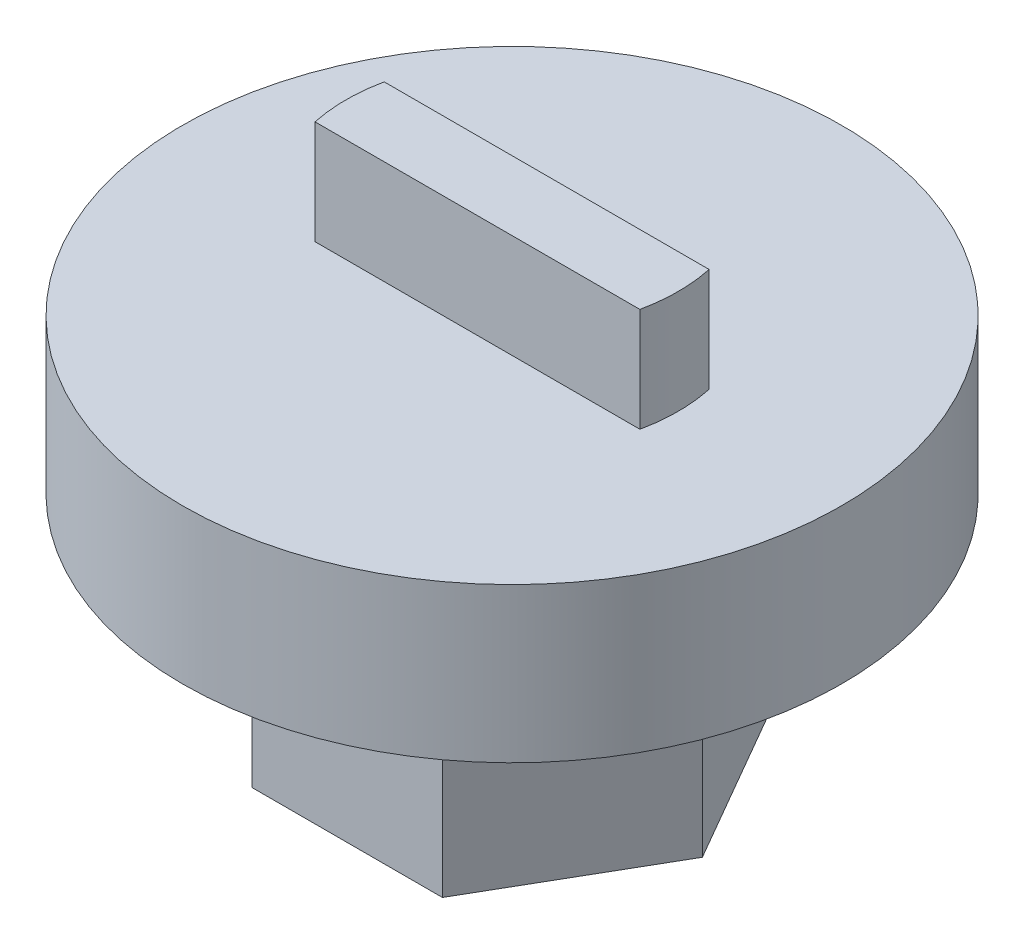
ISO-10303-21;
HEADER;
FILE_DESCRIPTION(('STEP AP214'),'2;1');
FILE_NAME('part.step','',(''),(''),'','','');
FILE_SCHEMA(('AUTOMOTIVE_DESIGN { 1 0 10303 214 1 1 1 1 }'));
ENDSEC;
DATA;
#1=APPLICATION_CONTEXT('core data for automotive mechanical design processes');
#2=APPLICATION_PROTOCOL_DEFINITION('international standard','automotive_design',2000,#1);
#3=PRODUCT_CONTEXT('',#1,'mechanical');
#4=PRODUCT('Part','Part','',(#3));
#5=PRODUCT_RELATED_PRODUCT_CATEGORY('part','',(#4));
#6=PRODUCT_DEFINITION_FORMATION('','',#4);
#7=PRODUCT_DEFINITION_CONTEXT('part definition',#1,'design');
#8=PRODUCT_DEFINITION('design','',#6,#7);
#9=PRODUCT_DEFINITION_SHAPE('','',#8);
#10=(LENGTH_UNIT() NAMED_UNIT(*) SI_UNIT(.MILLI.,.METRE.));
#11=(NAMED_UNIT(*) PLANE_ANGLE_UNIT() SI_UNIT($,.RADIAN.));
#12=(NAMED_UNIT(*) SI_UNIT($,.STERADIAN.) SOLID_ANGLE_UNIT());
#13=UNCERTAINTY_MEASURE_WITH_UNIT(LENGTH_MEASURE(1.E-05),#10,'distance_accuracy_value','');
#14=(GEOMETRIC_REPRESENTATION_CONTEXT(3) GLOBAL_UNCERTAINTY_ASSIGNED_CONTEXT((#13)) GLOBAL_UNIT_ASSIGNED_CONTEXT((#10,
#11,#12)) REPRESENTATION_CONTEXT('',''));
#15=CARTESIAN_POINT('',(0.,0.,0.));
#16=DIRECTION('',(0.,0.,1.));
#17=DIRECTION('',(1.,0.,0.));
#18=AXIS2_PLACEMENT_3D('',#15,#16,#17);
#19=CARTESIAN_POINT('',(0.,5.40512,0.));
#20=DIRECTION('',(0.,1.,0.));
#21=DIRECTION('',(0.,0.,1.));
#22=AXIS2_PLACEMENT_3D('',#19,#20,#21);
#23=PLANE('',#22);
#24=CARTESIAN_POINT('',(0.,5.40512,0.));
#25=DIRECTION('',(0.,1.,0.));
#26=DIRECTION('',(0.,0.,1.));
#27=AXIS2_PLACEMENT_3D('',#24,#25,#26);
#28=CIRCLE('',#27,4.7625);
#29=CARTESIAN_POINT('',(0.,5.40512,4.7625));
#30=VERTEX_POINT('',#29);
#31=EDGE_CURVE('E136',#30,#30,#28,.T.);
#32=ORIENTED_EDGE('',*,*,#31,.T.);
#33=EDGE_LOOP('',(#32));
#34=FACE_BOUND('',#33,.T.);
#35=DIRECTION('',(1.,0.,0.));
#36=VECTOR('',#35,1.);
#37=CARTESIAN_POINT('',(2.3473389188611,5.40512,0.5));
#38=LINE('',#37,#36);
#39=CARTESIAN_POINT('',(-2.3473389188611,5.40512,0.5));
#40=VERTEX_POINT('',#39);
#41=CARTESIAN_POINT('',(2.3473389188611,5.40512,0.5));
#42=VERTEX_POINT('',#41);
#43=EDGE_CURVE('E177',#40,#42,#38,.T.);
#44=ORIENTED_EDGE('',*,*,#43,.F.);
#45=CARTESIAN_POINT('',(0.,5.40512,0.));
#46=DIRECTION('',(0.,1.,0.));
#47=DIRECTION('',(0.,0.,1.));
#48=AXIS2_PLACEMENT_3D('',#45,#46,#47);
#49=CIRCLE('',#48,2.4);
#50=CARTESIAN_POINT('',(-2.3473389188611,5.40512,-0.499999999999998));
#51=VERTEX_POINT('',#50);
#52=EDGE_CURVE('E180',#51,#40,#49,.T.);
#53=ORIENTED_EDGE('',*,*,#52,.F.);
#54=DIRECTION('',(-1.,0.,0.));
#55=VECTOR('',#54,1.);
#56=CARTESIAN_POINT('',(-2.3473389188611,5.40512,-0.499999999999998));
#57=LINE('',#56,#55);
#58=CARTESIAN_POINT('',(2.3473389188611,5.40512,-0.500000000000001));
#59=VERTEX_POINT('',#58);
#60=EDGE_CURVE('E172',#59,#51,#57,.T.);
#61=ORIENTED_EDGE('',*,*,#60,.F.);
#62=CARTESIAN_POINT('',(0.,5.40512,0.));
#63=DIRECTION('',(0.,1.,0.));
#64=DIRECTION('',(0.,0.,1.));
#65=AXIS2_PLACEMENT_3D('',#62,#63,#64);
#66=CIRCLE('',#65,2.4);
#67=EDGE_CURVE('E175',#42,#59,#66,.T.);
#68=ORIENTED_EDGE('',*,*,#67,.F.);
#69=EDGE_LOOP('',(#44,#53,#61,#68));
#70=FACE_BOUND('',#69,.T.);
#71=ADVANCED_FACE('F32',(#34,#70),#23,.T.);
#72=CARTESIAN_POINT('',(2.74963065701559,3.175,0.));
#73=DIRECTION('',(-0.866025403784439,0.,0.5));
#74=DIRECTION('',(0.5,0.,0.866025403784439));
#75=AXIS2_PLACEMENT_3D('',#72,#73,#74);
#76=PLANE('',#75);
#77=DIRECTION('',(-0.5,0.,-0.866025403784439));
#78=VECTOR('',#77,1.);
#79=CARTESIAN_POINT('',(2.74963065701559,0.,0.));
#80=LINE('',#79,#78);
#81=CARTESIAN_POINT('',(2.74963065701559,0.,0.));
#82=VERTEX_POINT('',#81);
#83=CARTESIAN_POINT('',(1.3748153285078,0.,-2.38125));
#84=VERTEX_POINT('',#83);
#85=EDGE_CURVE('E132',#82,#84,#80,.T.);
#86=ORIENTED_EDGE('',*,*,#85,.T.);
#87=DIRECTION('',(0.,-1.,0.));
#88=VECTOR('',#87,1.);
#89=CARTESIAN_POINT('',(1.3748153285078,3.175,-2.38125));
#90=LINE('',#89,#88);
#91=CARTESIAN_POINT('',(1.3748153285078,3.175,-2.38125));
#92=VERTEX_POINT('',#91);
#93=EDGE_CURVE('E11',#92,#84,#90,.T.);
#94=ORIENTED_EDGE('',*,*,#93,.F.);
#95=DIRECTION('',(-0.5,0.,-0.866025403784439));
#96=VECTOR('',#95,1.);
#97=CARTESIAN_POINT('',(2.74963065701559,3.175,0.));
#98=LINE('',#97,#96);
#99=CARTESIAN_POINT('',(2.74963065701559,3.175,0.));
#100=VERTEX_POINT('',#99);
#101=EDGE_CURVE('E124',#100,#92,#98,.T.);
#102=ORIENTED_EDGE('',*,*,#101,.F.);
#103=DIRECTION('',(0.,-1.,0.));
#104=VECTOR('',#103,1.);
#105=CARTESIAN_POINT('',(2.74963065701559,3.175,0.));
#106=LINE('',#105,#104);
#107=EDGE_CURVE('E131',#100,#82,#106,.T.);
#108=ORIENTED_EDGE('',*,*,#107,.T.);
#109=EDGE_LOOP('',(#86,#94,#102,#108));
#110=FACE_BOUND('',#109,.T.);
#111=ADVANCED_FACE('F34',(#110),#76,.F.);
#112=CARTESIAN_POINT('',(1.3748153285078,3.175,-2.38125));
#113=DIRECTION('',(0.,0.,1.));
#114=DIRECTION('',(1.,0.,0.));
#115=AXIS2_PLACEMENT_3D('',#112,#113,#114);
#116=PLANE('',#115);
#117=DIRECTION('',(-1.,0.,0.));
#118=VECTOR('',#117,1.);
#119=CARTESIAN_POINT('',(1.3748153285078,0.,-2.38125));
#120=LINE('',#119,#118);
#121=CARTESIAN_POINT('',(-1.3748153285078,0.,-2.38125));
#122=VERTEX_POINT('',#121);
#123=EDGE_CURVE('E135',#84,#122,#120,.T.);
#124=ORIENTED_EDGE('',*,*,#123,.T.);
#125=DIRECTION('',(0.,-1.,0.));
#126=VECTOR('',#125,1.);
#127=CARTESIAN_POINT('',(-1.3748153285078,3.175,-2.38125));
#128=LINE('',#127,#126);
#129=CARTESIAN_POINT('',(-1.3748153285078,3.175,-2.38125));
#130=VERTEX_POINT('',#129);
#131=EDGE_CURVE('E40',#130,#122,#128,.T.);
#132=ORIENTED_EDGE('',*,*,#131,.F.);
#133=DIRECTION('',(-1.,0.,0.));
#134=VECTOR('',#133,1.);
#135=CARTESIAN_POINT('',(1.3748153285078,3.175,-2.38125));
#136=LINE('',#135,#134);
#137=EDGE_CURVE('E91',#92,#130,#136,.T.);
#138=ORIENTED_EDGE('',*,*,#137,.F.);
#139=ORIENTED_EDGE('',*,*,#93,.T.);
#140=EDGE_LOOP('',(#124,#132,#138,#139));
#141=FACE_BOUND('',#140,.T.);
#142=ADVANCED_FACE('F240',(#141),#116,.F.);
#143=CARTESIAN_POINT('',(-1.3748153285078,3.175,-2.38125));
#144=DIRECTION('',(0.866025403784439,0.,0.5));
#145=DIRECTION('',(0.5,0.,-0.866025403784439));
#146=AXIS2_PLACEMENT_3D('',#143,#144,#145);
#147=PLANE('',#146);
#148=DIRECTION('',(-0.5,0.,0.866025403784439));
#149=VECTOR('',#148,1.);
#150=CARTESIAN_POINT('',(-1.3748153285078,0.,-2.38125));
#151=LINE('',#150,#149);
#152=CARTESIAN_POINT('',(-2.74963065701559,0.,0.));
#153=VERTEX_POINT('',#152);
#154=EDGE_CURVE('E107',#122,#153,#151,.T.);
#155=ORIENTED_EDGE('',*,*,#154,.T.);
#156=DIRECTION('',(0.,-1.,0.));
#157=VECTOR('',#156,1.);
#158=CARTESIAN_POINT('',(-2.74963065701559,3.175,0.));
#159=LINE('',#158,#157);
#160=CARTESIAN_POINT('',(-2.74963065701559,3.175,0.));
#161=VERTEX_POINT('',#160);
#162=EDGE_CURVE('E100',#161,#153,#159,.T.);
#163=ORIENTED_EDGE('',*,*,#162,.F.);
#164=DIRECTION('',(-0.5,0.,0.866025403784439));
#165=VECTOR('',#164,1.);
#166=CARTESIAN_POINT('',(-1.3748153285078,3.175,-2.38125));
#167=LINE('',#166,#165);
#168=EDGE_CURVE('E105',#130,#161,#167,.T.);
#169=ORIENTED_EDGE('',*,*,#168,.F.);
#170=ORIENTED_EDGE('',*,*,#131,.T.);
#171=EDGE_LOOP('',(#155,#163,#169,#170));
#172=FACE_BOUND('',#171,.T.);
#173=ADVANCED_FACE('F102',(#172),#147,.F.);
#174=CARTESIAN_POINT('',(-2.74963065701559,3.175,0.));
#175=DIRECTION('',(0.866025403784438,0.,-0.5));
#176=DIRECTION('',(-0.5,0.,-0.866025403784439));
#177=AXIS2_PLACEMENT_3D('',#174,#175,#176);
#178=PLANE('',#177);
#179=DIRECTION('',(0.5,0.,0.866025403784438));
#180=VECTOR('',#179,1.);
#181=CARTESIAN_POINT('',(-2.74963065701559,0.,0.));
#182=LINE('',#181,#180);
#183=CARTESIAN_POINT('',(-1.37481532850779,0.,2.38125));
#184=VERTEX_POINT('',#183);
#185=EDGE_CURVE('E139',#153,#184,#182,.T.);
#186=ORIENTED_EDGE('',*,*,#185,.T.);
#187=DIRECTION('',(0.,-1.,0.));
#188=VECTOR('',#187,1.);
#189=CARTESIAN_POINT('',(-1.37481532850779,3.175,2.38125));
#190=LINE('',#189,#188);
#191=CARTESIAN_POINT('',(-1.37481532850779,3.175,2.38125));
#192=VERTEX_POINT('',#191);
#193=EDGE_CURVE('E110',#192,#184,#190,.T.);
#194=ORIENTED_EDGE('',*,*,#193,.F.);
#195=DIRECTION('',(0.5,0.,0.866025403784438));
#196=VECTOR('',#195,1.);
#197=CARTESIAN_POINT('',(-2.74963065701559,3.175,0.));
#198=LINE('',#197,#196);
#199=EDGE_CURVE('E113',#161,#192,#198,.T.);
#200=ORIENTED_EDGE('',*,*,#199,.F.);
#201=ORIENTED_EDGE('',*,*,#162,.T.);
#202=EDGE_LOOP('',(#186,#194,#200,#201));
#203=FACE_BOUND('',#202,.T.);
#204=ADVANCED_FACE('F114',(#203),#178,.F.);
#205=CARTESIAN_POINT('',(-1.37481532850779,3.175,2.38125));
#206=DIRECTION('',(0.,0.,-1.));
#207=DIRECTION('',(-1.,0.,0.));
#208=AXIS2_PLACEMENT_3D('',#205,#206,#207);
#209=PLANE('',#208);
#210=DIRECTION('',(1.,0.,0.));
#211=VECTOR('',#210,1.);
#212=CARTESIAN_POINT('',(-1.37481532850779,0.,2.38125));
#213=LINE('',#212,#211);
#214=CARTESIAN_POINT('',(1.3748153285078,0.,2.38125));
#215=VERTEX_POINT('',#214);
#216=EDGE_CURVE('E141',#184,#215,#213,.T.);
#217=ORIENTED_EDGE('',*,*,#216,.T.);
#218=DIRECTION('',(0.,-1.,0.));
#219=VECTOR('',#218,1.);
#220=CARTESIAN_POINT('',(1.3748153285078,3.175,2.38125));
#221=LINE('',#220,#219);
#222=CARTESIAN_POINT('',(1.3748153285078,3.175,2.38125));
#223=VERTEX_POINT('',#222);
#224=EDGE_CURVE('E56',#223,#215,#221,.T.);
#225=ORIENTED_EDGE('',*,*,#224,.F.);
#226=DIRECTION('',(1.,0.,0.));
#227=VECTOR('',#226,1.);
#228=CARTESIAN_POINT('',(-1.37481532850779,3.175,2.38125));
#229=LINE('',#228,#227);
#230=EDGE_CURVE('E118',#192,#223,#229,.T.);
#231=ORIENTED_EDGE('',*,*,#230,.F.);
#232=ORIENTED_EDGE('',*,*,#193,.T.);
#233=EDGE_LOOP('',(#217,#225,#231,#232));
#234=FACE_BOUND('',#233,.T.);
#235=ADVANCED_FACE('F150',(#234),#209,.F.);
#236=CARTESIAN_POINT('',(1.3748153285078,3.175,2.38125));
#237=DIRECTION('',(-0.866025403784439,0.,-0.5));
#238=DIRECTION('',(-0.5,0.,0.866025403784439));
#239=AXIS2_PLACEMENT_3D('',#236,#237,#238);
#240=PLANE('',#239);
#241=DIRECTION('',(0.5,0.,-0.866025403784439));
#242=VECTOR('',#241,1.);
#243=CARTESIAN_POINT('',(1.3748153285078,0.,2.38125));
#244=LINE('',#243,#242);
#245=EDGE_CURVE('E83',#215,#82,#244,.T.);
#246=ORIENTED_EDGE('',*,*,#245,.T.);
#247=ORIENTED_EDGE('',*,*,#107,.F.);
#248=DIRECTION('',(0.5,0.,-0.866025403784439));
#249=VECTOR('',#248,1.);
#250=CARTESIAN_POINT('',(1.3748153285078,3.175,2.38125));
#251=LINE('',#250,#249);
#252=EDGE_CURVE('E129',#223,#100,#251,.T.);
#253=ORIENTED_EDGE('',*,*,#252,.F.);
#254=ORIENTED_EDGE('',*,*,#224,.T.);
#255=EDGE_LOOP('',(#246,#247,#253,#254));
#256=FACE_BOUND('',#255,.T.);
#257=ADVANCED_FACE('F153',(#256),#240,.F.);
#258=CARTESIAN_POINT('',(0.,0.,0.));
#259=DIRECTION('',(0.,1.,0.));
#260=DIRECTION('',(0.,0.,1.));
#261=AXIS2_PLACEMENT_3D('',#258,#259,#260);
#262=PLANE('',#261);
#263=ORIENTED_EDGE('',*,*,#85,.F.);
#264=ORIENTED_EDGE('',*,*,#245,.F.);
#265=ORIENTED_EDGE('',*,*,#216,.F.);
#266=ORIENTED_EDGE('',*,*,#185,.F.);
#267=ORIENTED_EDGE('',*,*,#154,.F.);
#268=ORIENTED_EDGE('',*,*,#123,.F.);
#269=EDGE_LOOP('',(#263,#264,#265,#266,#267,#268));
#270=FACE_BOUND('',#269,.T.);
#271=ADVANCED_FACE('F148',(#270),#262,.F.);
#272=CARTESIAN_POINT('',(0.,3.175,0.));
#273=DIRECTION('',(0.,1.,0.));
#274=DIRECTION('',(0.,0.,1.));
#275=AXIS2_PLACEMENT_3D('',#272,#273,#274);
#276=PLANE('',#275);
#277=CARTESIAN_POINT('',(0.,3.175,0.));
#278=DIRECTION('',(0.,1.,0.));
#279=DIRECTION('',(0.,0.,1.));
#280=AXIS2_PLACEMENT_3D('',#277,#278,#279);
#281=CIRCLE('',#280,4.7625);
#282=CARTESIAN_POINT('',(0.,3.175,4.7625));
#283=VERTEX_POINT('',#282);
#284=EDGE_CURVE('E156',#283,#283,#281,.T.);
#285=ORIENTED_EDGE('',*,*,#284,.F.);
#286=EDGE_LOOP('',(#285));
#287=FACE_BOUND('',#286,.T.);
#288=ORIENTED_EDGE('',*,*,#252,.T.);
#289=ORIENTED_EDGE('',*,*,#101,.T.);
#290=ORIENTED_EDGE('',*,*,#137,.T.);
#291=ORIENTED_EDGE('',*,*,#168,.T.);
#292=ORIENTED_EDGE('',*,*,#199,.T.);
#293=ORIENTED_EDGE('',*,*,#230,.T.);
#294=EDGE_LOOP('',(#288,#289,#290,#291,#292,#293));
#295=FACE_BOUND('',#294,.T.);
#296=ADVANCED_FACE('F121',(#287,#295),#276,.F.);
#297=CARTESIAN_POINT('',(0.,5.40512,0.));
#298=DIRECTION('',(0.,-1.,0.));
#299=DIRECTION('',(0.,0.,-1.));
#300=AXIS2_PLACEMENT_3D('',#297,#298,#299);
#301=CYLINDRICAL_SURFACE('',#300,4.7625);
#302=ORIENTED_EDGE('',*,*,#31,.F.);
#303=EDGE_LOOP('',(#302));
#304=FACE_BOUND('',#303,.T.);
#305=ORIENTED_EDGE('',*,*,#284,.T.);
#306=EDGE_LOOP('',(#305));
#307=FACE_BOUND('',#306,.T.);
#308=ADVANCED_FACE('F244',(#304,#307),#301,.T.);
#309=CARTESIAN_POINT('',(0.,6.90512,0.));
#310=DIRECTION('',(0.,-1.,0.));
#311=DIRECTION('',(0.,0.,-1.));
#312=AXIS2_PLACEMENT_3D('',#309,#310,#311);
#313=CYLINDRICAL_SURFACE('',#312,2.4);
#314=ORIENTED_EDGE('',*,*,#52,.T.);
#315=DIRECTION('',(0.,-1.,0.));
#316=VECTOR('',#315,1.);
#317=CARTESIAN_POINT('',(-2.3473389188611,6.90512,0.5));
#318=LINE('',#317,#316);
#319=CARTESIAN_POINT('',(-2.3473389188611,6.90512,0.5));
#320=VERTEX_POINT('',#319);
#321=EDGE_CURVE('E159',#320,#40,#318,.T.);
#322=ORIENTED_EDGE('',*,*,#321,.F.);
#323=CARTESIAN_POINT('',(0.,6.90512,0.));
#324=DIRECTION('',(0.,1.,0.));
#325=DIRECTION('',(0.,0.,1.));
#326=AXIS2_PLACEMENT_3D('',#323,#324,#325);
#327=CIRCLE('',#326,2.4);
#328=CARTESIAN_POINT('',(-2.3473389188611,6.90512,-0.499999999999998));
#329=VERTEX_POINT('',#328);
#330=EDGE_CURVE('E174',#329,#320,#327,.T.);
#331=ORIENTED_EDGE('',*,*,#330,.F.);
#332=DIRECTION('',(0.,-1.,0.));
#333=VECTOR('',#332,1.);
#334=CARTESIAN_POINT('',(-2.3473389188611,6.90512,-0.499999999999998));
#335=LINE('',#334,#333);
#336=EDGE_CURVE('E168',#329,#51,#335,.T.);
#337=ORIENTED_EDGE('',*,*,#336,.T.);
#338=EDGE_LOOP('',(#314,#322,#331,#337));
#339=FACE_BOUND('',#338,.T.);
#340=ADVANCED_FACE('F204',(#339),#313,.T.);
#341=CARTESIAN_POINT('',(2.3473389188611,6.90512,0.5));
#342=DIRECTION('',(0.,0.,-1.));
#343=DIRECTION('',(-1.,0.,0.));
#344=AXIS2_PLACEMENT_3D('',#341,#342,#343);
#345=PLANE('',#344);
#346=ORIENTED_EDGE('',*,*,#43,.T.);
#347=DIRECTION('',(0.,-1.,0.));
#348=VECTOR('',#347,1.);
#349=CARTESIAN_POINT('',(2.3473389188611,6.90512,0.5));
#350=LINE('',#349,#348);
#351=CARTESIAN_POINT('',(2.3473389188611,6.90512,0.5));
#352=VERTEX_POINT('',#351);
#353=EDGE_CURVE('E164',#352,#42,#350,.T.);
#354=ORIENTED_EDGE('',*,*,#353,.F.);
#355=DIRECTION('',(1.,0.,0.));
#356=VECTOR('',#355,1.);
#357=CARTESIAN_POINT('',(2.3473389188611,6.90512,0.5));
#358=LINE('',#357,#356);
#359=EDGE_CURVE('E188',#320,#352,#358,.T.);
#360=ORIENTED_EDGE('',*,*,#359,.F.);
#361=ORIENTED_EDGE('',*,*,#321,.T.);
#362=EDGE_LOOP('',(#346,#354,#360,#361));
#363=FACE_BOUND('',#362,.T.);
#364=ADVANCED_FACE('F209',(#363),#345,.F.);
#365=CARTESIAN_POINT('',(0.,6.90512,0.));
#366=DIRECTION('',(0.,-1.,0.));
#367=DIRECTION('',(0.,0.,-1.));
#368=AXIS2_PLACEMENT_3D('',#365,#366,#367);
#369=CYLINDRICAL_SURFACE('',#368,2.4);
#370=ORIENTED_EDGE('',*,*,#67,.T.);
#371=DIRECTION('',(0.,-1.,0.));
#372=VECTOR('',#371,1.);
#373=CARTESIAN_POINT('',(2.3473389188611,6.90512,-0.500000000000001));
#374=LINE('',#373,#372);
#375=CARTESIAN_POINT('',(2.3473389188611,6.90512,-0.500000000000001));
#376=VERTEX_POINT('',#375);
#377=EDGE_CURVE('E47',#376,#59,#374,.T.);
#378=ORIENTED_EDGE('',*,*,#377,.F.);
#379=CARTESIAN_POINT('',(0.,6.90512,0.));
#380=DIRECTION('',(0.,1.,0.));
#381=DIRECTION('',(0.,0.,1.));
#382=AXIS2_PLACEMENT_3D('',#379,#380,#381);
#383=CIRCLE('',#382,2.4);
#384=EDGE_CURVE('E185',#352,#376,#383,.T.);
#385=ORIENTED_EDGE('',*,*,#384,.F.);
#386=ORIENTED_EDGE('',*,*,#353,.T.);
#387=EDGE_LOOP('',(#370,#378,#385,#386));
#388=FACE_BOUND('',#387,.T.);
#389=ADVANCED_FACE('F220',(#388),#369,.T.);
#390=CARTESIAN_POINT('',(-2.3473389188611,6.90512,-0.499999999999998));
#391=DIRECTION('',(0.,0.,1.));
#392=DIRECTION('',(1.,0.,0.));
#393=AXIS2_PLACEMENT_3D('',#390,#391,#392);
#394=PLANE('',#393);
#395=ORIENTED_EDGE('',*,*,#60,.T.);
#396=ORIENTED_EDGE('',*,*,#336,.F.);
#397=DIRECTION('',(-1.,0.,0.));
#398=VECTOR('',#397,1.);
#399=CARTESIAN_POINT('',(-2.3473389188611,6.90512,-0.499999999999998));
#400=LINE('',#399,#398);
#401=EDGE_CURVE('E171',#376,#329,#400,.T.);
#402=ORIENTED_EDGE('',*,*,#401,.F.);
#403=ORIENTED_EDGE('',*,*,#377,.T.);
#404=EDGE_LOOP('',(#395,#396,#402,#403));
#405=FACE_BOUND('',#404,.T.);
#406=ADVANCED_FACE('F216',(#405),#394,.F.);
#407=CARTESIAN_POINT('',(0.,6.90512,0.));
#408=DIRECTION('',(0.,1.,0.));
#409=DIRECTION('',(0.,0.,1.));
#410=AXIS2_PLACEMENT_3D('',#407,#408,#409);
#411=PLANE('',#410);
#412=ORIENTED_EDGE('',*,*,#330,.T.);
#413=ORIENTED_EDGE('',*,*,#359,.T.);
#414=ORIENTED_EDGE('',*,*,#384,.T.);
#415=ORIENTED_EDGE('',*,*,#401,.T.);
#416=EDGE_LOOP('',(#412,#413,#414,#415));
#417=FACE_BOUND('',#416,.T.);
#418=ADVANCED_FACE('F196',(#417),#411,.T.);
#419=CLOSED_SHELL('',(#71,#111,#142,#173,#204,#235,#257,#271,#296,#308,#340,#364,#389,#406,#418));
#420=MANIFOLD_SOLID_BREP('B2',#419);
#421=ADVANCED_BREP_SHAPE_REPRESENTATION('',(#18,#420),#14);
#422=SHAPE_DEFINITION_REPRESENTATION(#9,#421);
ENDSEC;
END-ISO-10303-21;
